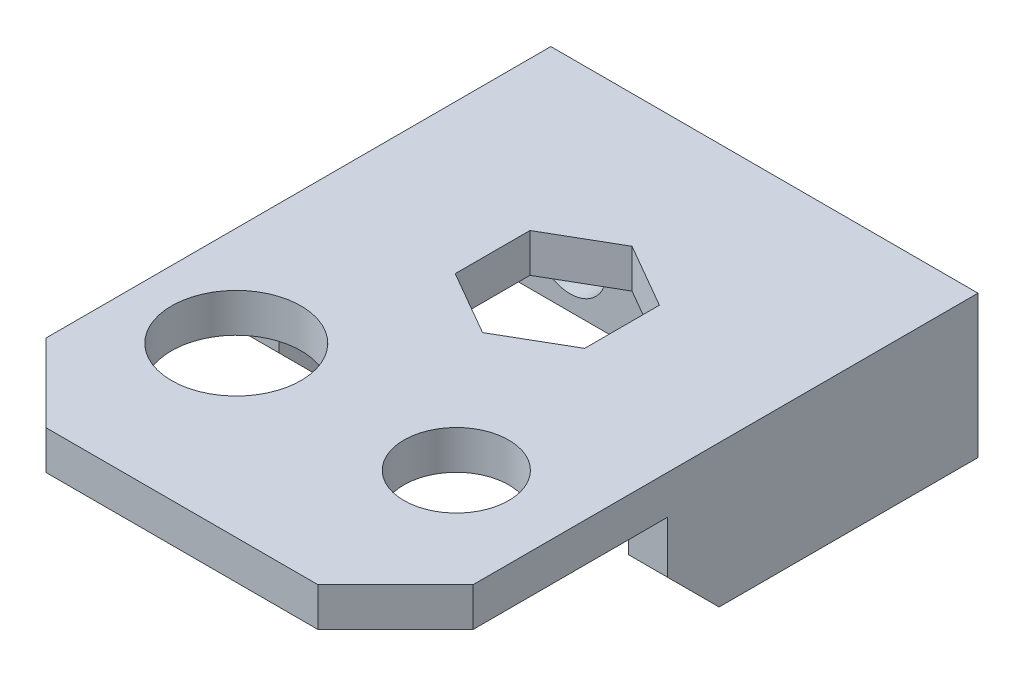
ISO-10303-21;
HEADER;
FILE_DESCRIPTION(('STEP AP214'),'2;1');
FILE_NAME('part.step','',(''),(''),'','','');
FILE_SCHEMA(('AUTOMOTIVE_DESIGN { 1 0 10303 214 1 1 1 1 }'));
ENDSEC;
DATA;
#1=APPLICATION_CONTEXT('core data for automotive mechanical design processes');
#2=APPLICATION_PROTOCOL_DEFINITION('international standard','automotive_design',2000,#1);
#3=PRODUCT_CONTEXT('',#1,'mechanical');
#4=PRODUCT('Part','Part','',(#3));
#5=PRODUCT_RELATED_PRODUCT_CATEGORY('part','',(#4));
#6=PRODUCT_DEFINITION_FORMATION('','',#4);
#7=PRODUCT_DEFINITION_CONTEXT('part definition',#1,'design');
#8=PRODUCT_DEFINITION('design','',#6,#7);
#9=PRODUCT_DEFINITION_SHAPE('','',#8);
#10=(LENGTH_UNIT() NAMED_UNIT(*) SI_UNIT(.MILLI.,.METRE.));
#11=(NAMED_UNIT(*) PLANE_ANGLE_UNIT() SI_UNIT($,.RADIAN.));
#12=(NAMED_UNIT(*) SI_UNIT($,.STERADIAN.) SOLID_ANGLE_UNIT());
#13=UNCERTAINTY_MEASURE_WITH_UNIT(LENGTH_MEASURE(1.E-05),#10,'distance_accuracy_value','');
#14=(GEOMETRIC_REPRESENTATION_CONTEXT(3) GLOBAL_UNCERTAINTY_ASSIGNED_CONTEXT((#13)) GLOBAL_UNIT_ASSIGNED_CONTEXT((#10,
#11,#12)) REPRESENTATION_CONTEXT('',''));
#15=CARTESIAN_POINT('',(0.,0.,0.));
#16=DIRECTION('',(0.,0.,1.));
#17=DIRECTION('',(1.,0.,0.));
#18=AXIS2_PLACEMENT_3D('',#15,#16,#17);
#19=CARTESIAN_POINT('',(17.8010870987601,-4.,-32.));
#20=DIRECTION('',(0.,0.,1.));
#21=DIRECTION('',(1.,0.,0.));
#22=AXIS2_PLACEMENT_3D('',#19,#20,#21);
#23=CYLINDRICAL_SURFACE('',#22,1.55);
#24=CARTESIAN_POINT('',(17.8010870987601,-4.,-32.));
#25=DIRECTION('',(0.,0.,1.));
#26=DIRECTION('',(1.,0.,0.));
#27=AXIS2_PLACEMENT_3D('',#24,#25,#26);
#28=CIRCLE('',#27,1.55);
#29=CARTESIAN_POINT('',(19.3510870987601,-4.,-32.));
#30=VERTEX_POINT('',#29);
#31=EDGE_CURVE('E487',#30,#30,#28,.T.);
#32=ORIENTED_EDGE('',*,*,#31,.F.);
#33=EDGE_LOOP('',(#32));
#34=FACE_BOUND('',#33,.T.);
#35=CARTESIAN_POINT('',(17.8010870987601,-4.,-29.));
#36=DIRECTION('',(0.,0.,1.));
#37=DIRECTION('',(1.,0.,0.));
#38=AXIS2_PLACEMENT_3D('',#35,#36,#37);
#39=CIRCLE('',#38,1.55);
#40=CARTESIAN_POINT('',(19.3510870987601,-4.,-29.));
#41=VERTEX_POINT('',#40);
#42=EDGE_CURVE('E505',#41,#41,#39,.T.);
#43=ORIENTED_EDGE('',*,*,#42,.T.);
#44=EDGE_LOOP('',(#43));
#45=FACE_BOUND('',#44,.T.);
#46=ADVANCED_FACE('F35',(#34,#45),#23,.F.);
#47=CARTESIAN_POINT('',(-0.198912901239866,-4.,-32.));
#48=DIRECTION('',(0.,0.,1.));
#49=DIRECTION('',(1.,0.,0.));
#50=AXIS2_PLACEMENT_3D('',#47,#48,#49);
#51=CYLINDRICAL_SURFACE('',#50,1.55);
#52=CARTESIAN_POINT('',(-0.198912901239866,-4.,-32.));
#53=DIRECTION('',(0.,0.,1.));
#54=DIRECTION('',(1.,0.,0.));
#55=AXIS2_PLACEMENT_3D('',#52,#53,#54);
#56=CIRCLE('',#55,1.55);
#57=CARTESIAN_POINT('',(1.35108709876013,-4.,-32.));
#58=VERTEX_POINT('',#57);
#59=EDGE_CURVE('E191',#58,#58,#56,.T.);
#60=ORIENTED_EDGE('',*,*,#59,.F.);
#61=EDGE_LOOP('',(#60));
#62=FACE_BOUND('',#61,.T.);
#63=CARTESIAN_POINT('',(-0.198912901239866,-4.,-29.));
#64=DIRECTION('',(0.,0.,1.));
#65=DIRECTION('',(1.,0.,0.));
#66=AXIS2_PLACEMENT_3D('',#63,#64,#65);
#67=CIRCLE('',#66,1.55);
#68=CARTESIAN_POINT('',(1.35108709876013,-4.,-29.));
#69=VERTEX_POINT('',#68);
#70=EDGE_CURVE('E496',#69,#69,#67,.T.);
#71=ORIENTED_EDGE('',*,*,#70,.T.);
#72=EDGE_LOOP('',(#71));
#73=FACE_BOUND('',#72,.T.);
#74=ADVANCED_FACE('F400',(#62,#73),#51,.F.);
#75=CARTESIAN_POINT('',(0.,0.,0.));
#76=DIRECTION('',(0.,-1.,0.));
#77=DIRECTION('',(0.,0.,-1.));
#78=AXIS2_PLACEMENT_3D('',#75,#76,#77);
#79=PLANE('',#78);
#80=DIRECTION('',(0.866025403784439,0.,0.499999999999999));
#81=VECTOR('',#80,1.);
#82=CARTESIAN_POINT('',(3.80108709876013,0.,-13.1132486540519));
#83=LINE('',#82,#81);
#84=CARTESIAN_POINT('',(3.80108709876013,0.,-13.1132486540519));
#85=VERTEX_POINT('',#84);
#86=CARTESIAN_POINT('',(8.80108709876014,0.,-10.2264973081037));
#87=VERTEX_POINT('',#86);
#88=EDGE_CURVE('E298',#85,#87,#83,.T.);
#89=ORIENTED_EDGE('',*,*,#88,.T.);
#90=DIRECTION('',(0.866025403784439,0.,-0.5));
#91=VECTOR('',#90,1.);
#92=CARTESIAN_POINT('',(8.80108709876014,0.,-10.2264973081037));
#93=LINE('',#92,#91);
#94=CARTESIAN_POINT('',(13.8010870987601,0.,-13.1132486540519));
#95=VERTEX_POINT('',#94);
#96=EDGE_CURVE('E301',#87,#95,#93,.T.);
#97=ORIENTED_EDGE('',*,*,#96,.T.);
#98=DIRECTION('',(0.,0.,-1.));
#99=VECTOR('',#98,1.);
#100=CARTESIAN_POINT('',(13.8010870987601,0.,-13.1132486540519));
#101=LINE('',#100,#99);
#102=CARTESIAN_POINT('',(13.8010870987601,0.,-18.8867513459481));
#103=VERTEX_POINT('',#102);
#104=EDGE_CURVE('E50',#95,#103,#101,.T.);
#105=ORIENTED_EDGE('',*,*,#104,.T.);
#106=DIRECTION('',(-0.866025403784439,0.,-0.5));
#107=VECTOR('',#106,1.);
#108=CARTESIAN_POINT('',(13.8010870987601,0.,-18.8867513459481));
#109=LINE('',#108,#107);
#110=CARTESIAN_POINT('',(8.80108709876014,0.,-21.7735026918962));
#111=VERTEX_POINT('',#110);
#112=EDGE_CURVE('E306',#103,#111,#109,.T.);
#113=ORIENTED_EDGE('',*,*,#112,.T.);
#114=DIRECTION('',(-0.866025403784438,0.,0.5));
#115=VECTOR('',#114,1.);
#116=CARTESIAN_POINT('',(8.80108709876014,0.,-21.7735026918962));
#117=LINE('',#116,#115);
#118=CARTESIAN_POINT('',(3.80108709876013,0.,-18.8867513459481));
#119=VERTEX_POINT('',#118);
#120=EDGE_CURVE('E309',#111,#119,#117,.T.);
#121=ORIENTED_EDGE('',*,*,#120,.T.);
#122=DIRECTION('',(0.,0.,1.));
#123=VECTOR('',#122,1.);
#124=CARTESIAN_POINT('',(3.80108709876013,0.,-18.8867513459481));
#125=LINE('',#124,#123);
#126=EDGE_CURVE('E312',#119,#85,#125,.T.);
#127=ORIENTED_EDGE('',*,*,#126,.T.);
#128=EDGE_LOOP('',(#89,#97,#105,#113,#121,#127));
#129=FACE_BOUND('',#128,.T.);
#130=CARTESIAN_POINT('',(0.,0.,0.));
#131=DIRECTION('',(0.,1.,0.));
#132=DIRECTION('',(0.,0.,1.));
#133=AXIS2_PLACEMENT_3D('',#130,#131,#132);
#134=CIRCLE('',#133,5.);
#135=CARTESIAN_POINT('',(0.,0.,5.));
#136=VERTEX_POINT('',#135);
#137=EDGE_CURVE('E229',#136,#136,#134,.T.);
#138=ORIENTED_EDGE('',*,*,#137,.T.);
#139=EDGE_LOOP('',(#138));
#140=FACE_BOUND('',#139,.T.);
#141=CARTESIAN_POINT('',(17.,0.,0.));
#142=DIRECTION('',(0.,1.,0.));
#143=DIRECTION('',(0.,0.,1.));
#144=AXIS2_PLACEMENT_3D('',#141,#142,#143);
#145=CIRCLE('',#144,4.05);
#146=CARTESIAN_POINT('',(17.,0.,4.05));
#147=VERTEX_POINT('',#146);
#148=EDGE_CURVE('E225',#147,#147,#145,.T.);
#149=ORIENTED_EDGE('',*,*,#148,.T.);
#150=EDGE_LOOP('',(#149));
#151=FACE_BOUND('',#150,.T.);
#152=DIRECTION('',(0.,0.,1.));
#153=VECTOR('',#152,1.);
#154=CARTESIAN_POINT('',(-4.69891290123986,0.,-7.99999999999998));
#155=LINE('',#154,#153);
#156=CARTESIAN_POINT('',(-4.69891290123986,0.,-26.));
#157=VERTEX_POINT('',#156);
#158=CARTESIAN_POINT('',(-4.69891290123986,0.,-7.99999999999998));
#159=VERTEX_POINT('',#158);
#160=EDGE_CURVE('E190',#157,#159,#155,.T.);
#161=ORIENTED_EDGE('',*,*,#160,.F.);
#162=DIRECTION('',(-1.,0.,0.));
#163=VECTOR('',#162,1.);
#164=CARTESIAN_POINT('',(-4.69891290123986,0.,-26.));
#165=LINE('',#164,#163);
#166=CARTESIAN_POINT('',(22.3010870987601,0.,-26.));
#167=VERTEX_POINT('',#166);
#168=EDGE_CURVE('E174',#167,#157,#165,.T.);
#169=ORIENTED_EDGE('',*,*,#168,.F.);
#170=DIRECTION('',(0.,0.,-1.));
#171=VECTOR('',#170,1.);
#172=CARTESIAN_POINT('',(22.3010870987601,0.,-29.));
#173=LINE('',#172,#171);
#174=CARTESIAN_POINT('',(22.3010870987601,0.,-8.));
#175=VERTEX_POINT('',#174);
#176=EDGE_CURVE('E188',#175,#167,#173,.T.);
#177=ORIENTED_EDGE('',*,*,#176,.F.);
#178=DIRECTION('',(-1.,0.,0.));
#179=VECTOR('',#178,1.);
#180=CARTESIAN_POINT('',(22.3010870987601,0.,-8.));
#181=LINE('',#180,#179);
#182=CARTESIAN_POINT('',(25.3010870987601,0.,-8.));
#183=VERTEX_POINT('',#182);
#184=EDGE_CURVE('E199',#183,#175,#181,.T.);
#185=ORIENTED_EDGE('',*,*,#184,.F.);
#186=DIRECTION('',(0.,0.,-1.));
#187=VECTOR('',#186,1.);
#188=CARTESIAN_POINT('',(25.3010870987601,0.,-32.));
#189=LINE('',#188,#187);
#190=CARTESIAN_POINT('',(25.3010870987601,0.,6.99999999999999));
#191=VERTEX_POINT('',#190);
#192=EDGE_CURVE('E235',#191,#183,#189,.T.);
#193=ORIENTED_EDGE('',*,*,#192,.F.);
#194=DIRECTION('',(0.707106781186548,0.,-0.707106781186547));
#195=VECTOR('',#194,1.);
#196=CARTESIAN_POINT('',(25.3010870987601,0.,6.99999999999999));
#197=LINE('',#196,#195);
#198=CARTESIAN_POINT('',(19.3010870987601,0.,13.));
#199=VERTEX_POINT('',#198);
#200=EDGE_CURVE('E242',#199,#191,#197,.T.);
#201=ORIENTED_EDGE('',*,*,#200,.F.);
#202=DIRECTION('',(1.,0.,0.));
#203=VECTOR('',#202,1.);
#204=CARTESIAN_POINT('',(19.3010870987601,0.,13.));
#205=LINE('',#204,#203);
#206=CARTESIAN_POINT('',(-1.69891290123986,0.,13.));
#207=VERTEX_POINT('',#206);
#208=EDGE_CURVE('E259',#207,#199,#205,.T.);
#209=ORIENTED_EDGE('',*,*,#208,.F.);
#210=DIRECTION('',(0.707106781186548,0.,0.707106781186548));
#211=VECTOR('',#210,1.);
#212=CARTESIAN_POINT('',(-1.69891290123986,0.,13.));
#213=LINE('',#212,#211);
#214=CARTESIAN_POINT('',(-7.69891290123986,0.,7.));
#215=VERTEX_POINT('',#214);
#216=EDGE_CURVE('E257',#215,#207,#213,.T.);
#217=ORIENTED_EDGE('',*,*,#216,.F.);
#218=DIRECTION('',(0.,0.,1.));
#219=VECTOR('',#218,1.);
#220=CARTESIAN_POINT('',(-7.69891290123986,0.,7.));
#221=LINE('',#220,#219);
#222=CARTESIAN_POINT('',(-7.69891290123986,0.,-7.99999999999998));
#223=VERTEX_POINT('',#222);
#224=EDGE_CURVE('E255',#223,#215,#221,.T.);
#225=ORIENTED_EDGE('',*,*,#224,.F.);
#226=DIRECTION('',(-1.,0.,0.));
#227=VECTOR('',#226,1.);
#228=CARTESIAN_POINT('',(-7.69891290123986,0.,-7.99999999999998));
#229=LINE('',#228,#227);
#230=EDGE_CURVE('E211',#159,#223,#229,.T.);
#231=ORIENTED_EDGE('',*,*,#230,.F.);
#232=EDGE_LOOP('',(#161,#169,#177,#185,#193,#201,#209,#217,#225,#231));
#233=FACE_BOUND('',#232,.T.);
#234=ADVANCED_FACE('F186',(#129,#140,#151,#233),#79,.T.);
#235=CARTESIAN_POINT('',(-4.69891290123986,-8.,-7.99999999999998));
#236=DIRECTION('',(-1.,0.,0.));
#237=DIRECTION('',(0.,0.,1.));
#238=AXIS2_PLACEMENT_3D('',#235,#236,#237);
#239=PLANE('',#238);
#240=DIRECTION('',(0.,1.,0.));
#241=VECTOR('',#240,1.);
#242=CARTESIAN_POINT('',(-4.69891290123986,-41.5410196624969,-26.));
#243=LINE('',#242,#241);
#244=CARTESIAN_POINT('',(-4.69891290123986,-8.,-26.));
#245=VERTEX_POINT('',#244);
#246=EDGE_CURVE('E181',#245,#157,#243,.T.);
#247=ORIENTED_EDGE('',*,*,#246,.T.);
#248=ORIENTED_EDGE('',*,*,#160,.T.);
#249=DIRECTION('',(0.,1.,0.));
#250=VECTOR('',#249,1.);
#251=CARTESIAN_POINT('',(-4.69891290123986,-8.,-7.99999999999998));
#252=LINE('',#251,#250);
#253=CARTESIAN_POINT('',(-4.69891290123986,-4.,-7.99999999999998));
#254=VERTEX_POINT('',#253);
#255=EDGE_CURVE('E217',#254,#159,#252,.T.);
#256=ORIENTED_EDGE('',*,*,#255,.F.);
#257=DIRECTION('',(0.,-0.707106781186548,-0.707106781186548));
#258=VECTOR('',#257,1.);
#259=CARTESIAN_POINT('',(-4.69891290123986,-6.,-9.99999999999998));
#260=LINE('',#259,#258);
#261=CARTESIAN_POINT('',(-4.69891290123986,-8.,-12.));
#262=VERTEX_POINT('',#261);
#263=EDGE_CURVE('E204',#254,#262,#260,.T.);
#264=ORIENTED_EDGE('',*,*,#263,.T.);
#265=DIRECTION('',(0.,0.,1.));
#266=VECTOR('',#265,1.);
#267=CARTESIAN_POINT('',(-4.69891290123986,-8.,-7.99999999999998));
#268=LINE('',#267,#266);
#269=EDGE_CURVE('E215',#245,#262,#268,.T.);
#270=ORIENTED_EDGE('',*,*,#269,.F.);
#271=EDGE_LOOP('',(#247,#248,#256,#264,#270));
#272=FACE_BOUND('',#271,.T.);
#273=ADVANCED_FACE('F384',(#272),#239,.F.);
#274=CARTESIAN_POINT('',(22.3010870987601,-8.,-29.));
#275=DIRECTION('',(1.,0.,0.));
#276=DIRECTION('',(0.,0.,-1.));
#277=AXIS2_PLACEMENT_3D('',#274,#275,#276);
#278=PLANE('',#277);
#279=DIRECTION('',(0.,1.,0.));
#280=VECTOR('',#279,1.);
#281=CARTESIAN_POINT('',(22.3010870987601,-41.5410196624969,-26.));
#282=LINE('',#281,#280);
#283=CARTESIAN_POINT('',(22.3010870987601,-8.,-26.));
#284=VERTEX_POINT('',#283);
#285=EDGE_CURVE('E170',#284,#167,#282,.T.);
#286=ORIENTED_EDGE('',*,*,#285,.F.);
#287=DIRECTION('',(0.,0.,-1.));
#288=VECTOR('',#287,1.);
#289=CARTESIAN_POINT('',(22.3010870987601,-8.,-29.));
#290=LINE('',#289,#288);
#291=CARTESIAN_POINT('',(22.3010870987601,-8.,-12.));
#292=VERTEX_POINT('',#291);
#293=EDGE_CURVE('E202',#292,#284,#290,.T.);
#294=ORIENTED_EDGE('',*,*,#293,.F.);
#295=DIRECTION('',(0.,0.707106781186548,0.707106781186548));
#296=VECTOR('',#295,1.);
#297=CARTESIAN_POINT('',(22.3010870987601,-16.5,-20.5));
#298=LINE('',#297,#296);
#299=CARTESIAN_POINT('',(22.3010870987601,-4.,-7.99999999999998));
#300=VERTEX_POINT('',#299);
#301=EDGE_CURVE('E349',#292,#300,#298,.T.);
#302=ORIENTED_EDGE('',*,*,#301,.T.);
#303=DIRECTION('',(0.,1.,0.));
#304=VECTOR('',#303,1.);
#305=CARTESIAN_POINT('',(22.3010870987601,-8.,-8.));
#306=LINE('',#305,#304);
#307=EDGE_CURVE('E196',#300,#175,#306,.T.);
#308=ORIENTED_EDGE('',*,*,#307,.T.);
#309=ORIENTED_EDGE('',*,*,#176,.T.);
#310=EDGE_LOOP('',(#286,#294,#302,#308,#309));
#311=FACE_BOUND('',#310,.T.);
#312=ADVANCED_FACE('F193',(#311),#278,.F.);
#313=CARTESIAN_POINT('',(0.,3.,0.));
#314=DIRECTION('',(0.,-1.,0.));
#315=DIRECTION('',(0.,0.,-1.));
#316=AXIS2_PLACEMENT_3D('',#313,#314,#315);
#317=PLANE('',#316);
#318=DIRECTION('',(0.866025403784439,0.,-0.5));
#319=VECTOR('',#318,1.);
#320=CARTESIAN_POINT('',(8.80108709876014,3.,-10.2264973081037));
#321=LINE('',#320,#319);
#322=CARTESIAN_POINT('',(8.80108709876014,3.,-10.2264973081037));
#323=VERTEX_POINT('',#322);
#324=CARTESIAN_POINT('',(13.8010870987601,3.,-13.1132486540519));
#325=VERTEX_POINT('',#324);
#326=EDGE_CURVE('E292',#323,#325,#321,.T.);
#327=ORIENTED_EDGE('',*,*,#326,.F.);
#328=DIRECTION('',(0.866025403784439,0.,0.499999999999999));
#329=VECTOR('',#328,1.);
#330=CARTESIAN_POINT('',(3.80108709876013,3.,-13.1132486540519));
#331=LINE('',#330,#329);
#332=CARTESIAN_POINT('',(3.80108709876013,3.,-13.1132486540519));
#333=VERTEX_POINT('',#332);
#334=EDGE_CURVE('E58',#333,#323,#331,.T.);
#335=ORIENTED_EDGE('',*,*,#334,.F.);
#336=DIRECTION('',(0.,0.,1.));
#337=VECTOR('',#336,1.);
#338=CARTESIAN_POINT('',(3.80108709876013,3.,-18.8867513459481));
#339=LINE('',#338,#337);
#340=CARTESIAN_POINT('',(3.80108709876013,3.,-18.8867513459481));
#341=VERTEX_POINT('',#340);
#342=EDGE_CURVE('E302',#341,#333,#339,.T.);
#343=ORIENTED_EDGE('',*,*,#342,.F.);
#344=DIRECTION('',(-0.866025403784438,0.,0.5));
#345=VECTOR('',#344,1.);
#346=CARTESIAN_POINT('',(8.80108709876014,3.,-21.7735026918962));
#347=LINE('',#346,#345);
#348=CARTESIAN_POINT('',(8.80108709876014,3.,-21.7735026918962));
#349=VERTEX_POINT('',#348);
#350=EDGE_CURVE('E324',#349,#341,#347,.T.);
#351=ORIENTED_EDGE('',*,*,#350,.F.);
#352=DIRECTION('',(-0.866025403784439,0.,-0.5));
#353=VECTOR('',#352,1.);
#354=CARTESIAN_POINT('',(13.8010870987601,3.,-18.8867513459481));
#355=LINE('',#354,#353);
#356=CARTESIAN_POINT('',(13.8010870987601,3.,-18.8867513459481));
#357=VERTEX_POINT('',#356);
#358=EDGE_CURVE('E321',#357,#349,#355,.T.);
#359=ORIENTED_EDGE('',*,*,#358,.F.);
#360=DIRECTION('',(0.,0.,-1.));
#361=VECTOR('',#360,1.);
#362=CARTESIAN_POINT('',(13.8010870987601,3.,-13.1132486540519));
#363=LINE('',#362,#361);
#364=EDGE_CURVE('E318',#325,#357,#363,.T.);
#365=ORIENTED_EDGE('',*,*,#364,.F.);
#366=EDGE_LOOP('',(#327,#335,#343,#351,#359,#365));
#367=FACE_BOUND('',#366,.T.);
#368=DIRECTION('',(0.,0.,-1.));
#369=VECTOR('',#368,1.);
#370=CARTESIAN_POINT('',(25.3010870987601,3.,-32.));
#371=LINE('',#370,#369);
#372=CARTESIAN_POINT('',(25.3010870987601,3.,6.99999999999999));
#373=VERTEX_POINT('',#372);
#374=CARTESIAN_POINT('',(25.3010870987601,3.,-32.));
#375=VERTEX_POINT('',#374);
#376=EDGE_CURVE('E238',#373,#375,#371,.T.);
#377=ORIENTED_EDGE('',*,*,#376,.T.);
#378=DIRECTION('',(-1.,0.,0.));
#379=VECTOR('',#378,1.);
#380=CARTESIAN_POINT('',(0.,3.,-32.));
#381=LINE('',#380,#379);
#382=CARTESIAN_POINT('',(-7.69891290123986,3.,-32.));
#383=VERTEX_POINT('',#382);
#384=EDGE_CURVE('E241',#375,#383,#381,.T.);
#385=ORIENTED_EDGE('',*,*,#384,.T.);
#386=DIRECTION('',(0.,0.,1.));
#387=VECTOR('',#386,1.);
#388=CARTESIAN_POINT('',(-7.69891290123986,3.,7.));
#389=LINE('',#388,#387);
#390=CARTESIAN_POINT('',(-7.69891290123986,3.,7.));
#391=VERTEX_POINT('',#390);
#392=EDGE_CURVE('E244',#383,#391,#389,.T.);
#393=ORIENTED_EDGE('',*,*,#392,.T.);
#394=DIRECTION('',(0.707106781186548,0.,0.707106781186548));
#395=VECTOR('',#394,1.);
#396=CARTESIAN_POINT('',(-1.69891290123986,3.,13.));
#397=LINE('',#396,#395);
#398=CARTESIAN_POINT('',(-1.69891290123986,3.,13.));
#399=VERTEX_POINT('',#398);
#400=EDGE_CURVE('E246',#391,#399,#397,.T.);
#401=ORIENTED_EDGE('',*,*,#400,.T.);
#402=DIRECTION('',(1.,0.,0.));
#403=VECTOR('',#402,1.);
#404=CARTESIAN_POINT('',(19.3010870987601,3.,13.));
#405=LINE('',#404,#403);
#406=CARTESIAN_POINT('',(19.3010870987601,3.,13.));
#407=VERTEX_POINT('',#406);
#408=EDGE_CURVE('E248',#399,#407,#405,.T.);
#409=ORIENTED_EDGE('',*,*,#408,.T.);
#410=DIRECTION('',(0.707106781186548,0.,-0.707106781186547));
#411=VECTOR('',#410,1.);
#412=CARTESIAN_POINT('',(25.3010870987601,3.,6.99999999999999));
#413=LINE('',#412,#411);
#414=EDGE_CURVE('E250',#407,#373,#413,.T.);
#415=ORIENTED_EDGE('',*,*,#414,.T.);
#416=EDGE_LOOP('',(#377,#385,#393,#401,#409,#415));
#417=FACE_BOUND('',#416,.T.);
#418=CARTESIAN_POINT('',(0.,3.,0.));
#419=DIRECTION('',(0.,1.,0.));
#420=DIRECTION('',(0.,0.,1.));
#421=AXIS2_PLACEMENT_3D('',#418,#419,#420);
#422=CIRCLE('',#421,5.);
#423=CARTESIAN_POINT('',(0.,3.,5.));
#424=VERTEX_POINT('',#423);
#425=EDGE_CURVE('E232',#424,#424,#422,.T.);
#426=ORIENTED_EDGE('',*,*,#425,.F.);
#427=EDGE_LOOP('',(#426));
#428=FACE_BOUND('',#427,.T.);
#429=CARTESIAN_POINT('',(17.,3.,0.));
#430=DIRECTION('',(0.,1.,0.));
#431=DIRECTION('',(0.,0.,1.));
#432=AXIS2_PLACEMENT_3D('',#429,#430,#431);
#433=CIRCLE('',#432,4.05);
#434=CARTESIAN_POINT('',(17.,3.,4.05));
#435=VERTEX_POINT('',#434);
#436=EDGE_CURVE('E226',#435,#435,#433,.T.);
#437=ORIENTED_EDGE('',*,*,#436,.F.);
#438=EDGE_LOOP('',(#437));
#439=FACE_BOUND('',#438,.T.);
#440=ADVANCED_FACE('F441',(#367,#417,#428,#439),#317,.F.);
#441=CARTESIAN_POINT('',(25.3010870987601,3.,-32.));
#442=DIRECTION('',(-1.,0.,0.));
#443=DIRECTION('',(0.,0.,1.));
#444=AXIS2_PLACEMENT_3D('',#441,#442,#443);
#445=PLANE('',#444);
#446=DIRECTION('',(0.,0.,1.));
#447=VECTOR('',#446,1.);
#448=CARTESIAN_POINT('',(25.3010870987601,-8.,-8.));
#449=LINE('',#448,#447);
#450=CARTESIAN_POINT('',(25.3010870987601,-8.,-32.));
#451=VERTEX_POINT('',#450);
#452=CARTESIAN_POINT('',(25.3010870987601,-8.,-12.));
#453=VERTEX_POINT('',#452);
#454=EDGE_CURVE('E198',#451,#453,#449,.T.);
#455=ORIENTED_EDGE('',*,*,#454,.F.);
#456=DIRECTION('',(0.,-1.,0.));
#457=VECTOR('',#456,1.);
#458=CARTESIAN_POINT('',(25.3010870987601,3.,-32.));
#459=LINE('',#458,#457);
#460=EDGE_CURVE('E11',#375,#451,#459,.T.);
#461=ORIENTED_EDGE('',*,*,#460,.F.);
#462=ORIENTED_EDGE('',*,*,#376,.F.);
#463=DIRECTION('',(0.,-1.,0.));
#464=VECTOR('',#463,1.);
#465=CARTESIAN_POINT('',(25.3010870987601,3.,6.99999999999999));
#466=LINE('',#465,#464);
#467=EDGE_CURVE('E252',#373,#191,#466,.T.);
#468=ORIENTED_EDGE('',*,*,#467,.T.);
#469=ORIENTED_EDGE('',*,*,#192,.T.);
#470=DIRECTION('',(0.,1.,0.));
#471=VECTOR('',#470,1.);
#472=CARTESIAN_POINT('',(25.3010870987601,-8.,-8.));
#473=LINE('',#472,#471);
#474=CARTESIAN_POINT('',(25.3010870987601,-4.,-7.99999999999998));
#475=VERTEX_POINT('',#474);
#476=EDGE_CURVE('E209',#475,#183,#473,.T.);
#477=ORIENTED_EDGE('',*,*,#476,.F.);
#478=DIRECTION('',(0.,-0.707106781186548,-0.707106781186548));
#479=VECTOR('',#478,1.);
#480=CARTESIAN_POINT('',(25.3010870987601,-8.,-12.));
#481=LINE('',#480,#479);
#482=EDGE_CURVE('E341',#475,#453,#481,.T.);
#483=ORIENTED_EDGE('',*,*,#482,.T.);
#484=EDGE_LOOP('',(#455,#461,#462,#468,#469,#477,#483));
#485=FACE_BOUND('',#484,.T.);
#486=ADVANCED_FACE('F37',(#485),#445,.F.);
#487=CARTESIAN_POINT('',(-7.69891290123986,3.,-32.));
#488=DIRECTION('',(0.,0.,1.));
#489=DIRECTION('',(1.,0.,0.));
#490=AXIS2_PLACEMENT_3D('',#487,#488,#489);
#491=PLANE('',#490);
#492=ORIENTED_EDGE('',*,*,#31,.T.);
#493=EDGE_LOOP('',(#492));
#494=FACE_BOUND('',#493,.T.);
#495=ORIENTED_EDGE('',*,*,#59,.T.);
#496=EDGE_LOOP('',(#495));
#497=FACE_BOUND('',#496,.T.);
#498=ORIENTED_EDGE('',*,*,#460,.T.);
#499=DIRECTION('',(-1.,0.,0.));
#500=VECTOR('',#499,1.);
#501=CARTESIAN_POINT('',(25.3010870987601,-8.,-32.));
#502=LINE('',#501,#500);
#503=CARTESIAN_POINT('',(-7.69891290123986,-8.,-32.));
#504=VERTEX_POINT('',#503);
#505=EDGE_CURVE('E285',#451,#504,#502,.T.);
#506=ORIENTED_EDGE('',*,*,#505,.T.);
#507=DIRECTION('',(0.,-1.,0.));
#508=VECTOR('',#507,1.);
#509=CARTESIAN_POINT('',(-7.69891290123986,3.,-32.));
#510=LINE('',#509,#508);
#511=EDGE_CURVE('E43',#383,#504,#510,.T.);
#512=ORIENTED_EDGE('',*,*,#511,.F.);
#513=ORIENTED_EDGE('',*,*,#384,.F.);
#514=EDGE_LOOP('',(#498,#506,#512,#513));
#515=FACE_BOUND('',#514,.T.);
#516=ADVANCED_FACE('F288',(#494,#497,#515),#491,.F.);
#517=CARTESIAN_POINT('',(-7.69891290123986,3.,7.));
#518=DIRECTION('',(1.,0.,0.));
#519=DIRECTION('',(0.,0.,-1.));
#520=AXIS2_PLACEMENT_3D('',#517,#518,#519);
#521=PLANE('',#520);
#522=DIRECTION('',(0.,0.,-1.));
#523=VECTOR('',#522,1.);
#524=CARTESIAN_POINT('',(-7.69891290123986,-8.,-7.99999999999998));
#525=LINE('',#524,#523);
#526=CARTESIAN_POINT('',(-7.69891290123986,-8.,-12.));
#527=VERTEX_POINT('',#526);
#528=EDGE_CURVE('E212',#527,#504,#525,.T.);
#529=ORIENTED_EDGE('',*,*,#528,.F.);
#530=DIRECTION('',(0.,-0.707106781186548,-0.707106781186548));
#531=VECTOR('',#530,1.);
#532=CARTESIAN_POINT('',(-7.69891290123986,-8.,-12.));
#533=LINE('',#532,#531);
#534=CARTESIAN_POINT('',(-7.69891290123986,-4.,-7.99999999999998));
#535=VERTEX_POINT('',#534);
#536=EDGE_CURVE('E331',#535,#527,#533,.T.);
#537=ORIENTED_EDGE('',*,*,#536,.F.);
#538=DIRECTION('',(0.,1.,0.));
#539=VECTOR('',#538,1.);
#540=CARTESIAN_POINT('',(-7.69891290123986,-8.,-7.99999999999998));
#541=LINE('',#540,#539);
#542=EDGE_CURVE('E223',#535,#223,#541,.T.);
#543=ORIENTED_EDGE('',*,*,#542,.T.);
#544=ORIENTED_EDGE('',*,*,#224,.T.);
#545=DIRECTION('',(0.,-1.,0.));
#546=VECTOR('',#545,1.);
#547=CARTESIAN_POINT('',(-7.69891290123986,3.,7.));
#548=LINE('',#547,#546);
#549=EDGE_CURVE('E270',#391,#215,#548,.T.);
#550=ORIENTED_EDGE('',*,*,#549,.F.);
#551=ORIENTED_EDGE('',*,*,#392,.F.);
#552=ORIENTED_EDGE('',*,*,#511,.T.);
#553=EDGE_LOOP('',(#529,#537,#543,#544,#550,#551,#552));
#554=FACE_BOUND('',#553,.T.);
#555=ADVANCED_FACE('F276',(#554),#521,.F.);
#556=CARTESIAN_POINT('',(-1.69891290123986,3.,13.));
#557=DIRECTION('',(0.707106781186547,0.,-0.707106781186547));
#558=DIRECTION('',(-0.707106781186548,0.,-0.707106781186548));
#559=AXIS2_PLACEMENT_3D('',#556,#557,#558);
#560=PLANE('',#559);
#561=ORIENTED_EDGE('',*,*,#216,.T.);
#562=DIRECTION('',(0.,-1.,0.));
#563=VECTOR('',#562,1.);
#564=CARTESIAN_POINT('',(-1.69891290123986,3.,13.));
#565=LINE('',#564,#563);
#566=EDGE_CURVE('E267',#399,#207,#565,.T.);
#567=ORIENTED_EDGE('',*,*,#566,.F.);
#568=ORIENTED_EDGE('',*,*,#400,.F.);
#569=ORIENTED_EDGE('',*,*,#549,.T.);
#570=EDGE_LOOP('',(#561,#567,#568,#569));
#571=FACE_BOUND('',#570,.T.);
#572=ADVANCED_FACE('F377',(#571),#560,.F.);
#573=CARTESIAN_POINT('',(19.3010870987601,3.,13.));
#574=DIRECTION('',(0.,0.,-1.));
#575=DIRECTION('',(-1.,0.,0.));
#576=AXIS2_PLACEMENT_3D('',#573,#574,#575);
#577=PLANE('',#576);
#578=ORIENTED_EDGE('',*,*,#208,.T.);
#579=DIRECTION('',(0.,-1.,0.));
#580=VECTOR('',#579,1.);
#581=CARTESIAN_POINT('',(19.3010870987601,3.,13.));
#582=LINE('',#581,#580);
#583=EDGE_CURVE('E264',#407,#199,#582,.T.);
#584=ORIENTED_EDGE('',*,*,#583,.F.);
#585=ORIENTED_EDGE('',*,*,#408,.F.);
#586=ORIENTED_EDGE('',*,*,#566,.T.);
#587=EDGE_LOOP('',(#578,#584,#585,#586));
#588=FACE_BOUND('',#587,.T.);
#589=ADVANCED_FACE('F372',(#588),#577,.F.);
#590=CARTESIAN_POINT('',(25.3010870987601,3.,6.99999999999999));
#591=DIRECTION('',(-0.707106781186547,0.,-0.707106781186548));
#592=DIRECTION('',(-0.707106781186548,0.,0.707106781186547));
#593=AXIS2_PLACEMENT_3D('',#590,#591,#592);
#594=PLANE('',#593);
#595=ORIENTED_EDGE('',*,*,#200,.T.);
#596=ORIENTED_EDGE('',*,*,#467,.F.);
#597=ORIENTED_EDGE('',*,*,#414,.F.);
#598=ORIENTED_EDGE('',*,*,#583,.T.);
#599=EDGE_LOOP('',(#595,#596,#597,#598));
#600=FACE_BOUND('',#599,.T.);
#601=ADVANCED_FACE('F366',(#600),#594,.F.);
#602=CARTESIAN_POINT('',(0.,3.,0.));
#603=DIRECTION('',(0.,-1.,0.));
#604=DIRECTION('',(0.,0.,-1.));
#605=AXIS2_PLACEMENT_3D('',#602,#603,#604);
#606=CYLINDRICAL_SURFACE('',#605,5.);
#607=ORIENTED_EDGE('',*,*,#425,.T.);
#608=EDGE_LOOP('',(#607));
#609=FACE_BOUND('',#608,.T.);
#610=ORIENTED_EDGE('',*,*,#137,.F.);
#611=EDGE_LOOP('',(#610));
#612=FACE_BOUND('',#611,.T.);
#613=ADVANCED_FACE('F459',(#609,#612),#606,.F.);
#614=CARTESIAN_POINT('',(17.,3.,0.));
#615=DIRECTION('',(0.,-1.,0.));
#616=DIRECTION('',(0.,0.,-1.));
#617=AXIS2_PLACEMENT_3D('',#614,#615,#616);
#618=CYLINDRICAL_SURFACE('',#617,4.05);
#619=ORIENTED_EDGE('',*,*,#436,.T.);
#620=EDGE_LOOP('',(#619));
#621=FACE_BOUND('',#620,.T.);
#622=ORIENTED_EDGE('',*,*,#148,.F.);
#623=EDGE_LOOP('',(#622));
#624=FACE_BOUND('',#623,.T.);
#625=ADVANCED_FACE('F457',(#621,#624),#618,.F.);
#626=CARTESIAN_POINT('',(-7.69891290123986,-8.,-7.99999999999998));
#627=DIRECTION('',(0.,0.,-1.));
#628=DIRECTION('',(-1.,0.,0.));
#629=AXIS2_PLACEMENT_3D('',#626,#627,#628);
#630=PLANE('',#629);
#631=ORIENTED_EDGE('',*,*,#542,.F.);
#632=DIRECTION('',(-1.,0.,0.));
#633=VECTOR('',#632,1.);
#634=CARTESIAN_POINT('',(25.3010870987601,-4.,-7.99999999999998));
#635=LINE('',#634,#633);
#636=EDGE_CURVE('E344',#254,#535,#635,.T.);
#637=ORIENTED_EDGE('',*,*,#636,.F.);
#638=ORIENTED_EDGE('',*,*,#255,.T.);
#639=ORIENTED_EDGE('',*,*,#230,.T.);
#640=EDGE_LOOP('',(#631,#637,#638,#639));
#641=FACE_BOUND('',#640,.T.);
#642=ADVANCED_FACE('F380',(#641),#630,.F.);
#643=CARTESIAN_POINT('',(0.,-8.,0.));
#644=DIRECTION('',(0.,1.,0.));
#645=DIRECTION('',(0.,0.,1.));
#646=AXIS2_PLACEMENT_3D('',#643,#644,#645);
#647=PLANE('',#646);
#648=DIRECTION('',(1.,0.,0.));
#649=VECTOR('',#648,1.);
#650=CARTESIAN_POINT('',(-4.69891290123986,-8.,-26.));
#651=LINE('',#650,#649);
#652=EDGE_CURVE('E176',#245,#284,#651,.T.);
#653=ORIENTED_EDGE('',*,*,#652,.F.);
#654=ORIENTED_EDGE('',*,*,#269,.T.);
#655=DIRECTION('',(-1.,0.,0.));
#656=VECTOR('',#655,1.);
#657=CARTESIAN_POINT('',(25.3010870987601,-8.,-12.));
#658=LINE('',#657,#656);
#659=EDGE_CURVE('E287',#262,#527,#658,.T.);
#660=ORIENTED_EDGE('',*,*,#659,.T.);
#661=ORIENTED_EDGE('',*,*,#528,.T.);
#662=ORIENTED_EDGE('',*,*,#505,.F.);
#663=ORIENTED_EDGE('',*,*,#454,.T.);
#664=EDGE_CURVE('E346',#453,#292,#658,.T.);
#665=ORIENTED_EDGE('',*,*,#664,.T.);
#666=ORIENTED_EDGE('',*,*,#293,.T.);
#667=EDGE_LOOP('',(#653,#654,#660,#661,#662,#663,#665,#666));
#668=FACE_BOUND('',#667,.T.);
#669=ADVANCED_FACE('F284',(#668),#647,.F.);
#670=CARTESIAN_POINT('',(22.3010870987601,-8.,-8.));
#671=DIRECTION('',(0.,0.,-1.));
#672=DIRECTION('',(-1.,0.,0.));
#673=AXIS2_PLACEMENT_3D('',#670,#671,#672);
#674=PLANE('',#673);
#675=ORIENTED_EDGE('',*,*,#307,.F.);
#676=EDGE_CURVE('E350',#475,#300,#635,.T.);
#677=ORIENTED_EDGE('',*,*,#676,.F.);
#678=ORIENTED_EDGE('',*,*,#476,.T.);
#679=ORIENTED_EDGE('',*,*,#184,.T.);
#680=EDGE_LOOP('',(#675,#677,#678,#679));
#681=FACE_BOUND('',#680,.T.);
#682=ADVANCED_FACE('F357',(#681),#674,.F.);
#683=CARTESIAN_POINT('',(25.3010870987601,-8.,-12.));
#684=DIRECTION('',(0.,0.707106781186547,-0.707106781186547));
#685=DIRECTION('',(0.,0.707106781186548,0.707106781186548));
#686=AXIS2_PLACEMENT_3D('',#683,#684,#685);
#687=PLANE('',#686);
#688=ORIENTED_EDGE('',*,*,#664,.F.);
#689=ORIENTED_EDGE('',*,*,#482,.F.);
#690=ORIENTED_EDGE('',*,*,#676,.T.);
#691=ORIENTED_EDGE('',*,*,#301,.F.);
#692=EDGE_LOOP('',(#688,#689,#690,#691));
#693=FACE_BOUND('',#692,.T.);
#694=ADVANCED_FACE('F390',(#693),#687,.F.);
#695=ORIENTED_EDGE('',*,*,#636,.T.);
#696=ORIENTED_EDGE('',*,*,#536,.T.);
#697=ORIENTED_EDGE('',*,*,#659,.F.);
#698=ORIENTED_EDGE('',*,*,#263,.F.);
#699=EDGE_LOOP('',(#695,#696,#697,#698));
#700=FACE_BOUND('',#699,.T.);
#701=ADVANCED_FACE('F387',(#700),#687,.F.);
#702=CARTESIAN_POINT('',(3.80108709876013,0.,-13.1132486540519));
#703=DIRECTION('',(-0.499999999999999,0.,0.866025403784439));
#704=DIRECTION('',(0.866025403784439,0.,0.499999999999999));
#705=AXIS2_PLACEMENT_3D('',#702,#703,#704);
#706=PLANE('',#705);
#707=ORIENTED_EDGE('',*,*,#334,.T.);
#708=DIRECTION('',(0.,1.,0.));
#709=VECTOR('',#708,1.);
#710=CARTESIAN_POINT('',(8.80108709876014,0.,-10.2264973081037));
#711=LINE('',#710,#709);
#712=EDGE_CURVE('E314',#87,#323,#711,.T.);
#713=ORIENTED_EDGE('',*,*,#712,.F.);
#714=ORIENTED_EDGE('',*,*,#88,.F.);
#715=DIRECTION('',(0.,1.,0.));
#716=VECTOR('',#715,1.);
#717=CARTESIAN_POINT('',(3.80108709876013,0.,-13.1132486540519));
#718=LINE('',#717,#716);
#719=EDGE_CURVE('E329',#85,#333,#718,.T.);
#720=ORIENTED_EDGE('',*,*,#719,.T.);
#721=EDGE_LOOP('',(#707,#713,#714,#720));
#722=FACE_BOUND('',#721,.T.);
#723=ADVANCED_FACE('F389',(#722),#706,.F.);
#724=CARTESIAN_POINT('',(3.80108709876013,0.,-18.8867513459481));
#725=DIRECTION('',(-1.,0.,0.));
#726=DIRECTION('',(0.,0.,1.));
#727=AXIS2_PLACEMENT_3D('',#724,#725,#726);
#728=PLANE('',#727);
#729=ORIENTED_EDGE('',*,*,#342,.T.);
#730=ORIENTED_EDGE('',*,*,#719,.F.);
#731=ORIENTED_EDGE('',*,*,#126,.F.);
#732=DIRECTION('',(0.,1.,0.));
#733=VECTOR('',#732,1.);
#734=CARTESIAN_POINT('',(3.80108709876013,0.,-18.8867513459481));
#735=LINE('',#734,#733);
#736=EDGE_CURVE('E332',#119,#341,#735,.T.);
#737=ORIENTED_EDGE('',*,*,#736,.T.);
#738=EDGE_LOOP('',(#729,#730,#731,#737));
#739=FACE_BOUND('',#738,.T.);
#740=ADVANCED_FACE('F396',(#739),#728,.F.);
#741=CARTESIAN_POINT('',(8.80108709876014,0.,-21.7735026918962));
#742=DIRECTION('',(-0.5,0.,-0.866025403784439));
#743=DIRECTION('',(-0.866025403784439,0.,0.5));
#744=AXIS2_PLACEMENT_3D('',#741,#742,#743);
#745=PLANE('',#744);
#746=ORIENTED_EDGE('',*,*,#350,.T.);
#747=ORIENTED_EDGE('',*,*,#736,.F.);
#748=ORIENTED_EDGE('',*,*,#120,.F.);
#749=DIRECTION('',(0.,1.,0.));
#750=VECTOR('',#749,1.);
#751=CARTESIAN_POINT('',(8.80108709876014,0.,-21.7735026918962));
#752=LINE('',#751,#750);
#753=EDGE_CURVE('E334',#111,#349,#752,.T.);
#754=ORIENTED_EDGE('',*,*,#753,.T.);
#755=EDGE_LOOP('',(#746,#747,#748,#754));
#756=FACE_BOUND('',#755,.T.);
#757=ADVANCED_FACE('F420',(#756),#745,.F.);
#758=CARTESIAN_POINT('',(13.8010870987601,0.,-18.8867513459481));
#759=DIRECTION('',(0.5,0.,-0.866025403784439));
#760=DIRECTION('',(-0.866025403784439,0.,-0.5));
#761=AXIS2_PLACEMENT_3D('',#758,#759,#760);
#762=PLANE('',#761);
#763=ORIENTED_EDGE('',*,*,#358,.T.);
#764=ORIENTED_EDGE('',*,*,#753,.F.);
#765=ORIENTED_EDGE('',*,*,#112,.F.);
#766=DIRECTION('',(0.,1.,0.));
#767=VECTOR('',#766,1.);
#768=CARTESIAN_POINT('',(13.8010870987601,0.,-18.8867513459481));
#769=LINE('',#768,#767);
#770=EDGE_CURVE('E336',#103,#357,#769,.T.);
#771=ORIENTED_EDGE('',*,*,#770,.T.);
#772=EDGE_LOOP('',(#763,#764,#765,#771));
#773=FACE_BOUND('',#772,.T.);
#774=ADVANCED_FACE('F424',(#773),#762,.F.);
#775=CARTESIAN_POINT('',(13.8010870987601,0.,-13.1132486540519));
#776=DIRECTION('',(1.,0.,0.));
#777=DIRECTION('',(0.,0.,-1.));
#778=AXIS2_PLACEMENT_3D('',#775,#776,#777);
#779=PLANE('',#778);
#780=ORIENTED_EDGE('',*,*,#364,.T.);
#781=ORIENTED_EDGE('',*,*,#770,.F.);
#782=ORIENTED_EDGE('',*,*,#104,.F.);
#783=DIRECTION('',(0.,1.,0.));
#784=VECTOR('',#783,1.);
#785=CARTESIAN_POINT('',(13.8010870987601,0.,-13.1132486540519));
#786=LINE('',#785,#784);
#787=EDGE_CURVE('E338',#95,#325,#786,.T.);
#788=ORIENTED_EDGE('',*,*,#787,.T.);
#789=EDGE_LOOP('',(#780,#781,#782,#788));
#790=FACE_BOUND('',#789,.T.);
#791=ADVANCED_FACE('F428',(#790),#779,.F.);
#792=CARTESIAN_POINT('',(8.80108709876014,0.,-10.2264973081037));
#793=DIRECTION('',(0.5,0.,0.866025403784438));
#794=DIRECTION('',(0.866025403784439,0.,-0.5));
#795=AXIS2_PLACEMENT_3D('',#792,#793,#794);
#796=PLANE('',#795);
#797=ORIENTED_EDGE('',*,*,#326,.T.);
#798=ORIENTED_EDGE('',*,*,#787,.F.);
#799=ORIENTED_EDGE('',*,*,#96,.F.);
#800=ORIENTED_EDGE('',*,*,#712,.T.);
#801=EDGE_LOOP('',(#797,#798,#799,#800));
#802=FACE_BOUND('',#801,.T.);
#803=ADVANCED_FACE('F416',(#802),#796,.F.);
#804=CARTESIAN_POINT('',(-4.69891290123986,-41.5410196624969,-26.));
#805=DIRECTION('',(0.,0.,-1.));
#806=DIRECTION('',(-1.,0.,0.));
#807=AXIS2_PLACEMENT_3D('',#804,#805,#806);
#808=PLANE('',#807);
#809=CARTESIAN_POINT('',(17.8010870987601,-4.,-26.));
#810=DIRECTION('',(0.,0.,1.));
#811=DIRECTION('',(1.,0.,0.));
#812=AXIS2_PLACEMENT_3D('',#809,#810,#811);
#813=CIRCLE('',#812,2.8);
#814=CARTESIAN_POINT('',(20.6010870987601,-4.,-26.));
#815=VERTEX_POINT('',#814);
#816=EDGE_CURVE('E502',#815,#815,#813,.T.);
#817=ORIENTED_EDGE('',*,*,#816,.F.);
#818=EDGE_LOOP('',(#817));
#819=FACE_BOUND('',#818,.T.);
#820=CARTESIAN_POINT('',(-0.198912901239866,-4.,-26.));
#821=DIRECTION('',(0.,0.,1.));
#822=DIRECTION('',(1.,0.,0.));
#823=AXIS2_PLACEMENT_3D('',#820,#821,#822);
#824=CIRCLE('',#823,2.8);
#825=CARTESIAN_POINT('',(2.60108709876013,-4.,-26.));
#826=VERTEX_POINT('',#825);
#827=EDGE_CURVE('E493',#826,#826,#824,.T.);
#828=ORIENTED_EDGE('',*,*,#827,.F.);
#829=EDGE_LOOP('',(#828));
#830=FACE_BOUND('',#829,.T.);
#831=ORIENTED_EDGE('',*,*,#246,.F.);
#832=ORIENTED_EDGE('',*,*,#652,.T.);
#833=ORIENTED_EDGE('',*,*,#285,.T.);
#834=ORIENTED_EDGE('',*,*,#168,.T.);
#835=EDGE_LOOP('',(#831,#832,#833,#834));
#836=FACE_BOUND('',#835,.T.);
#837=ADVANCED_FACE('F173',(#819,#830,#836),#808,.F.);
#838=CARTESIAN_POINT('',(-0.198912901239866,-4.,-29.));
#839=DIRECTION('',(0.,0.,1.));
#840=DIRECTION('',(1.,0.,0.));
#841=AXIS2_PLACEMENT_3D('',#838,#839,#840);
#842=CYLINDRICAL_SURFACE('',#841,2.8);
#843=CARTESIAN_POINT('',(-0.198912901239866,-4.,-29.));
#844=DIRECTION('',(0.,0.,1.));
#845=DIRECTION('',(1.,0.,0.));
#846=AXIS2_PLACEMENT_3D('',#843,#844,#845);
#847=CIRCLE('',#846,2.8);
#848=CARTESIAN_POINT('',(2.60108709876013,-4.,-29.));
#849=VERTEX_POINT('',#848);
#850=EDGE_CURVE('E490',#849,#849,#847,.T.);
#851=ORIENTED_EDGE('',*,*,#850,.F.);
#852=EDGE_LOOP('',(#851));
#853=FACE_BOUND('',#852,.T.);
#854=ORIENTED_EDGE('',*,*,#827,.T.);
#855=EDGE_LOOP('',(#854));
#856=FACE_BOUND('',#855,.T.);
#857=ADVANCED_FACE('F411',(#853,#856),#842,.F.);
#858=CARTESIAN_POINT('',(-0.198912901239866,-4.,-29.));
#859=DIRECTION('',(0.,0.,1.));
#860=DIRECTION('',(1.,0.,0.));
#861=AXIS2_PLACEMENT_3D('',#858,#859,#860);
#862=PLANE('',#861);
#863=ORIENTED_EDGE('',*,*,#70,.F.);
#864=EDGE_LOOP('',(#863));
#865=FACE_BOUND('',#864,.T.);
#866=ORIENTED_EDGE('',*,*,#850,.T.);
#867=EDGE_LOOP('',(#866));
#868=FACE_BOUND('',#867,.T.);
#869=ADVANCED_FACE('F520',(#865,#868),#862,.T.);
#870=CARTESIAN_POINT('',(17.8010870987601,-4.,-29.));
#871=DIRECTION('',(0.,0.,1.));
#872=DIRECTION('',(1.,0.,0.));
#873=AXIS2_PLACEMENT_3D('',#870,#871,#872);
#874=CYLINDRICAL_SURFACE('',#873,2.8);
#875=CARTESIAN_POINT('',(17.8010870987601,-4.,-29.));
#876=DIRECTION('',(0.,0.,1.));
#877=DIRECTION('',(1.,0.,0.));
#878=AXIS2_PLACEMENT_3D('',#875,#876,#877);
#879=CIRCLE('',#878,2.8);
#880=CARTESIAN_POINT('',(20.6010870987601,-4.,-29.));
#881=VERTEX_POINT('',#880);
#882=EDGE_CURVE('E501',#881,#881,#879,.T.);
#883=ORIENTED_EDGE('',*,*,#882,.F.);
#884=EDGE_LOOP('',(#883));
#885=FACE_BOUND('',#884,.T.);
#886=ORIENTED_EDGE('',*,*,#816,.T.);
#887=EDGE_LOOP('',(#886));
#888=FACE_BOUND('',#887,.T.);
#889=ADVANCED_FACE('F514',(#885,#888),#874,.F.);
#890=CARTESIAN_POINT('',(17.8010870987601,-4.,-29.));
#891=DIRECTION('',(0.,0.,1.));
#892=DIRECTION('',(1.,0.,0.));
#893=AXIS2_PLACEMENT_3D('',#890,#891,#892);
#894=PLANE('',#893);
#895=ORIENTED_EDGE('',*,*,#42,.F.);
#896=EDGE_LOOP('',(#895));
#897=FACE_BOUND('',#896,.T.);
#898=ORIENTED_EDGE('',*,*,#882,.T.);
#899=EDGE_LOOP('',(#898));
#900=FACE_BOUND('',#899,.T.);
#901=ADVANCED_FACE('F511',(#897,#900),#894,.T.);
#902=CLOSED_SHELL('',(#46,#74,#234,#273,#312,#440,#486,#516,#555,#572,#589,#601,#613,#625,#642,
#669,#682,#694,#701,#723,#740,#757,#774,#791,#803,#837,#857,#869,#889,#901));
#903=MANIFOLD_SOLID_BREP('B2',#902);
#904=ADVANCED_BREP_SHAPE_REPRESENTATION('',(#18,#903),#14);
#905=SHAPE_DEFINITION_REPRESENTATION(#9,#904);
ENDSEC;
END-ISO-10303-21;
